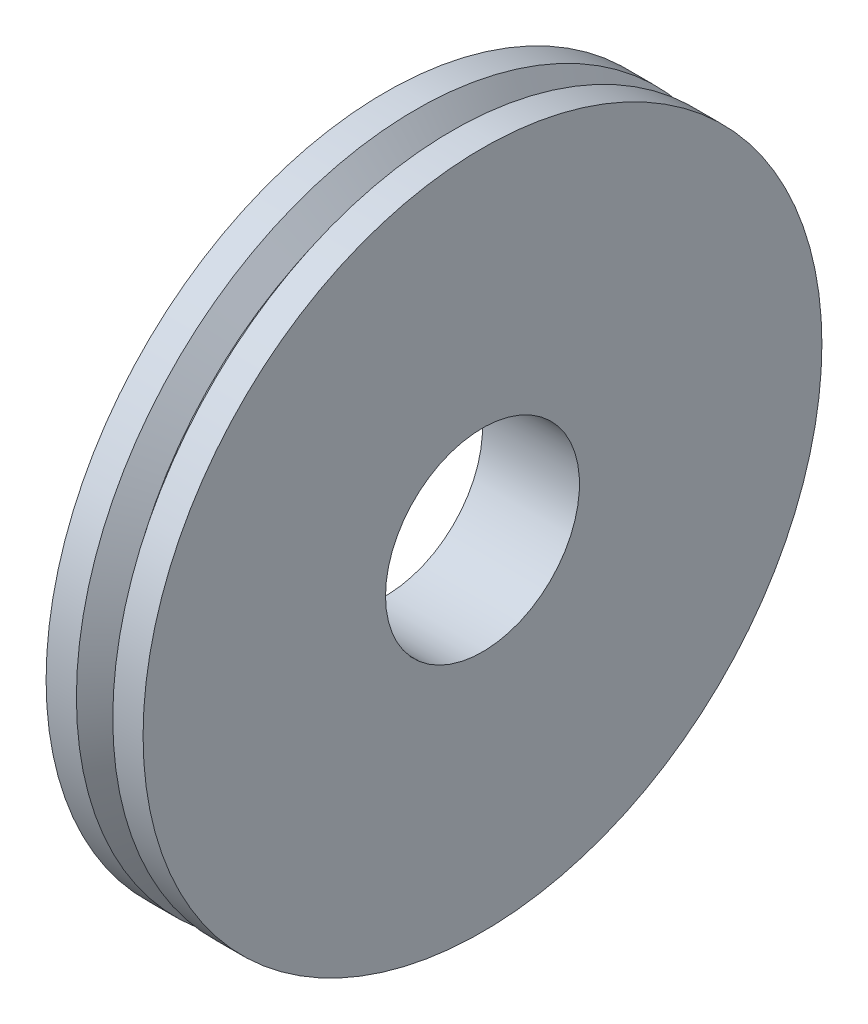
ISO-10303-21;
HEADER;
FILE_DESCRIPTION(('STEP AP214'),'2;1');
FILE_NAME('part.step','',(''),(''),'','','');
FILE_SCHEMA(('AUTOMOTIVE_DESIGN { 1 0 10303 214 1 1 1 1 }'));
ENDSEC;
DATA;
#1=APPLICATION_CONTEXT('core data for automotive mechanical design processes');
#2=APPLICATION_PROTOCOL_DEFINITION('international standard','automotive_design',2000,#1);
#3=PRODUCT_CONTEXT('',#1,'mechanical');
#4=PRODUCT('Part','Part','',(#3));
#5=PRODUCT_RELATED_PRODUCT_CATEGORY('part','',(#4));
#6=PRODUCT_DEFINITION_FORMATION('','',#4);
#7=PRODUCT_DEFINITION_CONTEXT('part definition',#1,'design');
#8=PRODUCT_DEFINITION('design','',#6,#7);
#9=PRODUCT_DEFINITION_SHAPE('','',#8);
#10=(LENGTH_UNIT() NAMED_UNIT(*) SI_UNIT(.MILLI.,.METRE.));
#11=(NAMED_UNIT(*) PLANE_ANGLE_UNIT() SI_UNIT($,.RADIAN.));
#12=(NAMED_UNIT(*) SI_UNIT($,.STERADIAN.) SOLID_ANGLE_UNIT());
#13=UNCERTAINTY_MEASURE_WITH_UNIT(LENGTH_MEASURE(1.E-05),#10,'distance_accuracy_value','');
#14=(GEOMETRIC_REPRESENTATION_CONTEXT(3) GLOBAL_UNCERTAINTY_ASSIGNED_CONTEXT((#13)) GLOBAL_UNIT_ASSIGNED_CONTEXT((#10,
#11,#12)) REPRESENTATION_CONTEXT('',''));
#15=CARTESIAN_POINT('',(0.,0.,0.));
#16=DIRECTION('',(0.,0.,1.));
#17=DIRECTION('',(1.,0.,0.));
#18=AXIS2_PLACEMENT_3D('',#15,#16,#17);
#19=CARTESIAN_POINT('',(-33.4645,0.,0.));
#20=DIRECTION('',(-1.,0.,0.));
#21=DIRECTION('',(0.,0.,1.));
#22=AXIS2_PLACEMENT_3D('',#19,#20,#21);
#23=CYLINDRICAL_SURFACE('',#22,4.);
#24=CARTESIAN_POINT('',(-1.06553666463839,0.,0.));
#25=DIRECTION('',(-1.,0.,0.));
#26=DIRECTION('',(0.,0.,1.));
#27=AXIS2_PLACEMENT_3D('',#24,#25,#26);
#28=CIRCLE('',#27,4.);
#29=CARTESIAN_POINT('',(-1.06553666463839,0.,4.));
#30=VERTEX_POINT('',#29);
#31=EDGE_CURVE('E55',#30,#30,#28,.T.);
#32=ORIENTED_EDGE('',*,*,#31,.F.);
#33=EDGE_LOOP('',(#32));
#34=FACE_BOUND('',#33,.T.);
#35=CARTESIAN_POINT('',(-5.06553666463839,0.,0.));
#36=DIRECTION('',(-1.,0.,0.));
#37=DIRECTION('',(0.,0.,1.));
#38=AXIS2_PLACEMENT_3D('',#35,#36,#37);
#39=CIRCLE('',#38,4.);
#40=CARTESIAN_POINT('',(-5.06553666463839,0.,4.));
#41=VERTEX_POINT('',#40);
#42=EDGE_CURVE('E10',#41,#41,#39,.T.);
#43=ORIENTED_EDGE('',*,*,#42,.T.);
#44=EDGE_LOOP('',(#43));
#45=FACE_BOUND('',#44,.T.);
#46=ADVANCED_FACE('F30',(#34,#45),#23,.F.);
#47=CARTESIAN_POINT('',(-5.06553666463839,4.,0.));
#48=DIRECTION('',(1.,0.,0.));
#49=DIRECTION('',(0.,0.,-1.));
#50=AXIS2_PLACEMENT_3D('',#47,#48,#49);
#51=PLANE('',#50);
#52=ORIENTED_EDGE('',*,*,#42,.F.);
#53=EDGE_LOOP('',(#52));
#54=FACE_BOUND('',#53,.T.);
#55=CARTESIAN_POINT('',(-5.06553666463839,0.,0.));
#56=DIRECTION('',(-1.,0.,0.));
#57=DIRECTION('',(0.,0.,1.));
#58=AXIS2_PLACEMENT_3D('',#55,#56,#57);
#59=CIRCLE('',#58,14.);
#60=CARTESIAN_POINT('',(-5.06553666463839,0.,14.));
#61=VERTEX_POINT('',#60);
#62=EDGE_CURVE('E36',#61,#61,#59,.T.);
#63=ORIENTED_EDGE('',*,*,#62,.T.);
#64=EDGE_LOOP('',(#63));
#65=FACE_BOUND('',#64,.T.);
#66=ADVANCED_FACE('F62',(#54,#65),#51,.F.);
#67=CARTESIAN_POINT('',(-33.4645,0.,0.));
#68=DIRECTION('',(-1.,0.,0.));
#69=DIRECTION('',(0.,0.,1.));
#70=AXIS2_PLACEMENT_3D('',#67,#68,#69);
#71=CYLINDRICAL_SURFACE('',#70,14.);
#72=ORIENTED_EDGE('',*,*,#62,.F.);
#73=EDGE_LOOP('',(#72));
#74=FACE_BOUND('',#73,.T.);
#75=CARTESIAN_POINT('',(-3.81553666463839,0.,0.));
#76=DIRECTION('',(-1.,0.,0.));
#77=DIRECTION('',(0.,0.,1.));
#78=AXIS2_PLACEMENT_3D('',#75,#76,#77);
#79=CIRCLE('',#78,14.);
#80=CARTESIAN_POINT('',(-3.81553666463839,0.,14.));
#81=VERTEX_POINT('',#80);
#82=EDGE_CURVE('E40',#81,#81,#79,.T.);
#83=ORIENTED_EDGE('',*,*,#82,.T.);
#84=EDGE_LOOP('',(#83));
#85=FACE_BOUND('',#84,.T.);
#86=ADVANCED_FACE('F66',(#74,#85),#71,.T.);
#87=CARTESIAN_POINT('',(-3.06553666463839,0.,0.));
#88=DIRECTION('',(-1.,0.,0.));
#89=DIRECTION('',(0.,0.,1.));
#90=AXIS2_PLACEMENT_3D('',#87,#88,#89);
#91=CONICAL_SURFACE('',#90,13.,0.927295218001611);
#92=ORIENTED_EDGE('',*,*,#82,.F.);
#93=EDGE_LOOP('',(#92));
#94=FACE_BOUND('',#93,.T.);
#95=CARTESIAN_POINT('',(-3.06553666463839,0.,0.));
#96=DIRECTION('',(-1.,0.,0.));
#97=DIRECTION('',(0.,0.,1.));
#98=AXIS2_PLACEMENT_3D('',#95,#96,#97);
#99=CIRCLE('',#98,13.);
#100=CARTESIAN_POINT('',(-3.06553666463839,0.,13.));
#101=VERTEX_POINT('',#100);
#102=EDGE_CURVE('E44',#101,#101,#99,.T.);
#103=ORIENTED_EDGE('',*,*,#102,.T.);
#104=EDGE_LOOP('',(#103));
#105=FACE_BOUND('',#104,.T.);
#106=ADVANCED_FACE('F71',(#94,#105),#91,.T.);
#107=CARTESIAN_POINT('',(-2.31553666463839,0.,0.));
#108=DIRECTION('',(1.,0.,0.));
#109=DIRECTION('',(0.,0.,-1.));
#110=AXIS2_PLACEMENT_3D('',#107,#108,#109);
#111=CONICAL_SURFACE('',#110,14.,0.927295218001614);
#112=ORIENTED_EDGE('',*,*,#102,.F.);
#113=EDGE_LOOP('',(#112));
#114=FACE_BOUND('',#113,.T.);
#115=CARTESIAN_POINT('',(-2.31553666463839,0.,0.));
#116=DIRECTION('',(-1.,0.,0.));
#117=DIRECTION('',(0.,0.,1.));
#118=AXIS2_PLACEMENT_3D('',#115,#116,#117);
#119=CIRCLE('',#118,14.);
#120=CARTESIAN_POINT('',(-2.31553666463839,0.,14.));
#121=VERTEX_POINT('',#120);
#122=EDGE_CURVE('E49',#121,#121,#119,.T.);
#123=ORIENTED_EDGE('',*,*,#122,.T.);
#124=EDGE_LOOP('',(#123));
#125=FACE_BOUND('',#124,.T.);
#126=ADVANCED_FACE('F77',(#114,#125),#111,.T.);
#127=CARTESIAN_POINT('',(-33.4645,0.,0.));
#128=DIRECTION('',(-1.,0.,0.));
#129=DIRECTION('',(0.,0.,1.));
#130=AXIS2_PLACEMENT_3D('',#127,#128,#129);
#131=CYLINDRICAL_SURFACE('',#130,14.);
#132=ORIENTED_EDGE('',*,*,#122,.F.);
#133=EDGE_LOOP('',(#132));
#134=FACE_BOUND('',#133,.T.);
#135=CARTESIAN_POINT('',(-1.06553666463839,0.,0.));
#136=DIRECTION('',(-1.,0.,0.));
#137=DIRECTION('',(0.,0.,1.));
#138=AXIS2_PLACEMENT_3D('',#135,#136,#137);
#139=CIRCLE('',#138,14.);
#140=CARTESIAN_POINT('',(-1.06553666463839,0.,14.));
#141=VERTEX_POINT('',#140);
#142=EDGE_CURVE('E52',#141,#141,#139,.T.);
#143=ORIENTED_EDGE('',*,*,#142,.T.);
#144=EDGE_LOOP('',(#143));
#145=FACE_BOUND('',#144,.T.);
#146=ADVANCED_FACE('F81',(#134,#145),#131,.T.);
#147=CARTESIAN_POINT('',(-1.06553666463839,14.,0.));
#148=DIRECTION('',(-1.,0.,0.));
#149=DIRECTION('',(0.,0.,1.));
#150=AXIS2_PLACEMENT_3D('',#147,#148,#149);
#151=PLANE('',#150);
#152=ORIENTED_EDGE('',*,*,#142,.F.);
#153=EDGE_LOOP('',(#152));
#154=FACE_BOUND('',#153,.T.);
#155=ORIENTED_EDGE('',*,*,#31,.T.);
#156=EDGE_LOOP('',(#155));
#157=FACE_BOUND('',#156,.T.);
#158=ADVANCED_FACE('F59',(#154,#157),#151,.F.);
#159=CLOSED_SHELL('',(#46,#66,#86,#106,#126,#146,#158));
#160=MANIFOLD_SOLID_BREP('B2',#159);
#161=ADVANCED_BREP_SHAPE_REPRESENTATION('',(#18,#160),#14);
#162=SHAPE_DEFINITION_REPRESENTATION(#9,#161);
ENDSEC;
END-ISO-10303-21;
